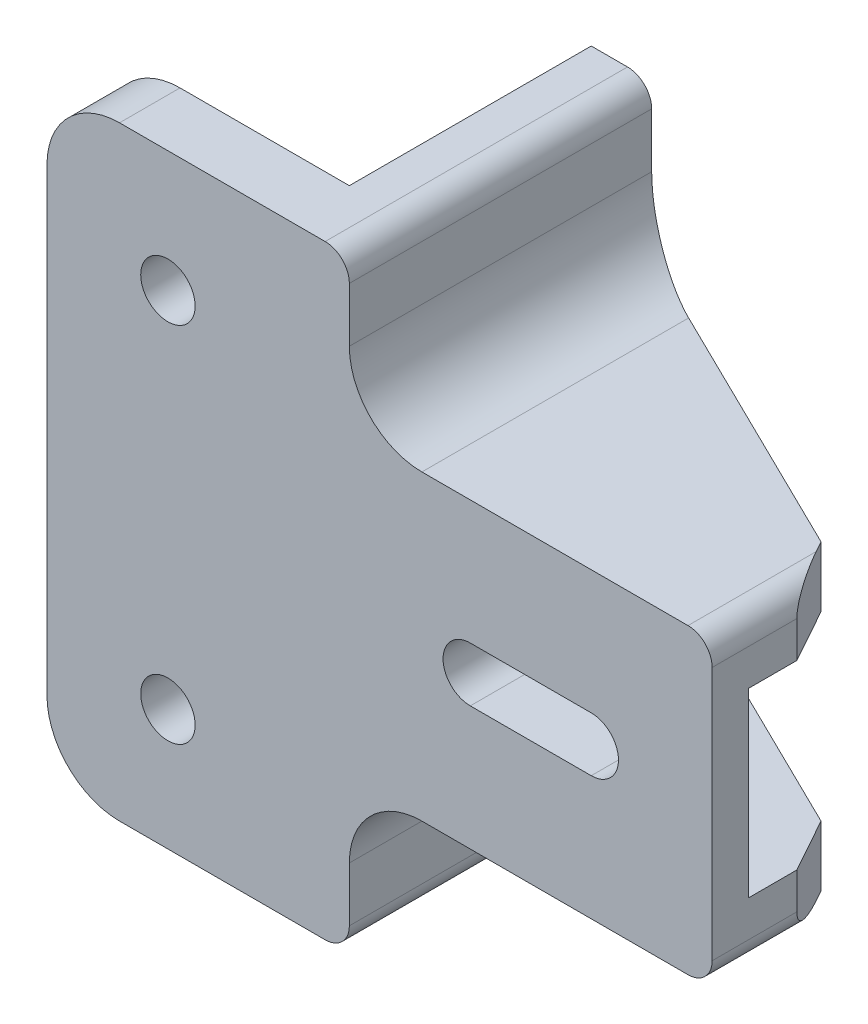
ISO-10303-21;
HEADER;
FILE_DESCRIPTION(('STEP AP214'),'2;1');
FILE_NAME('part.step','',(''),(''),'','','');
FILE_SCHEMA(('AUTOMOTIVE_DESIGN { 1 0 10303 214 1 1 1 1 }'));
ENDSEC;
DATA;
#1=APPLICATION_CONTEXT('core data for automotive mechanical design processes');
#2=APPLICATION_PROTOCOL_DEFINITION('international standard','automotive_design',2000,#1);
#3=PRODUCT_CONTEXT('',#1,'mechanical');
#4=PRODUCT('Part','Part','',(#3));
#5=PRODUCT_RELATED_PRODUCT_CATEGORY('part','',(#4));
#6=PRODUCT_DEFINITION_FORMATION('','',#4);
#7=PRODUCT_DEFINITION_CONTEXT('part definition',#1,'design');
#8=PRODUCT_DEFINITION('design','',#6,#7);
#9=PRODUCT_DEFINITION_SHAPE('','',#8);
#10=(LENGTH_UNIT() NAMED_UNIT(*) SI_UNIT(.MILLI.,.METRE.));
#11=(NAMED_UNIT(*) PLANE_ANGLE_UNIT() SI_UNIT($,.RADIAN.));
#12=(NAMED_UNIT(*) SI_UNIT($,.STERADIAN.) SOLID_ANGLE_UNIT());
#13=UNCERTAINTY_MEASURE_WITH_UNIT(LENGTH_MEASURE(1.E-05),#10,'distance_accuracy_value','');
#14=(GEOMETRIC_REPRESENTATION_CONTEXT(3) GLOBAL_UNCERTAINTY_ASSIGNED_CONTEXT((#13)) GLOBAL_UNIT_ASSIGNED_CONTEXT((#10,
#11,#12)) REPRESENTATION_CONTEXT('',''));
#15=CARTESIAN_POINT('',(0.,0.,0.));
#16=DIRECTION('',(0.,0.,1.));
#17=DIRECTION('',(1.,0.,0.));
#18=AXIS2_PLACEMENT_3D('',#15,#16,#17);
#19=CARTESIAN_POINT('',(-30.,-12.5,5.));
#20=DIRECTION('',(-1.,0.,0.));
#21=DIRECTION('',(0.,0.,1.));
#22=AXIS2_PLACEMENT_3D('',#19,#20,#21);
#23=PLANE('',#22);
#24=DIRECTION('',(0.,1.,0.));
#25=VECTOR('',#24,1.);
#26=CARTESIAN_POINT('',(-30.,-12.5,5.));
#27=LINE('',#26,#25);
#28=CARTESIAN_POINT('',(-30.,-10.5,5.));
#29=VERTEX_POINT('',#28);
#30=CARTESIAN_POINT('',(-30.,-6.,5.));
#31=VERTEX_POINT('',#30);
#32=EDGE_CURVE('E424',#29,#31,#27,.T.);
#33=ORIENTED_EDGE('',*,*,#32,.F.);
#34=DIRECTION('',(0.,0.,-1.));
#35=VECTOR('',#34,1.);
#36=CARTESIAN_POINT('',(-30.,-10.5,5.));
#37=LINE('',#36,#35);
#38=CARTESIAN_POINT('',(-30.,-10.5,-20.));
#39=VERTEX_POINT('',#38);
#40=EDGE_CURVE('E558',#29,#39,#37,.T.);
#41=ORIENTED_EDGE('',*,*,#40,.T.);
#42=DIRECTION('',(0.,-1.,0.));
#43=VECTOR('',#42,1.);
#44=CARTESIAN_POINT('',(-30.,-12.5,-20.));
#45=LINE('',#44,#43);
#46=CARTESIAN_POINT('',(-30.,-6.,-20.));
#47=VERTEX_POINT('',#46);
#48=EDGE_CURVE('E323',#47,#39,#45,.T.);
#49=ORIENTED_EDGE('',*,*,#48,.F.);
#50=DIRECTION('',(0.,0.,-1.));
#51=VECTOR('',#50,1.);
#52=CARTESIAN_POINT('',(-30.,-6.,5.));
#53=LINE('',#52,#51);
#54=EDGE_CURVE('E456',#47,#31,#53,.F.);
#55=ORIENTED_EDGE('',*,*,#54,.T.);
#56=EDGE_LOOP('',(#33,#41,#49,#55));
#57=FACE_BOUND('',#56,.T.);
#58=ADVANCED_FACE('F38',(#57),#23,.F.);
#59=CARTESIAN_POINT('',(-30.,35.5,-20.));
#60=VERTEX_POINT('',#59);
#61=CARTESIAN_POINT('',(-30.,31.,-20.));
#62=VERTEX_POINT('',#61);
#63=EDGE_CURVE('E318',#60,#62,#45,.T.);
#64=ORIENTED_EDGE('',*,*,#63,.F.);
#65=DIRECTION('',(0.,0.,-1.));
#66=VECTOR('',#65,1.);
#67=CARTESIAN_POINT('',(-30.,35.5,5.));
#68=LINE('',#67,#66);
#69=CARTESIAN_POINT('',(-30.,35.5,5.));
#70=VERTEX_POINT('',#69);
#71=EDGE_CURVE('E543',#60,#70,#68,.F.);
#72=ORIENTED_EDGE('',*,*,#71,.T.);
#73=DIRECTION('',(0.,1.,0.));
#74=VECTOR('',#73,1.);
#75=CARTESIAN_POINT('',(-30.,25.,5.));
#76=LINE('',#75,#74);
#77=CARTESIAN_POINT('',(-30.,31.,5.));
#78=VERTEX_POINT('',#77);
#79=EDGE_CURVE('E408',#78,#70,#76,.T.);
#80=ORIENTED_EDGE('',*,*,#79,.F.);
#81=DIRECTION('',(0.,0.,-1.));
#82=VECTOR('',#81,1.);
#83=CARTESIAN_POINT('',(-30.,31.,-20.));
#84=LINE('',#83,#82);
#85=EDGE_CURVE('E460',#78,#62,#84,.T.);
#86=ORIENTED_EDGE('',*,*,#85,.T.);
#87=EDGE_LOOP('',(#64,#72,#80,#86));
#88=FACE_BOUND('',#87,.T.);
#89=ADVANCED_FACE('F651',(#88),#23,.F.);
#90=CARTESIAN_POINT('',(0.,0.,0.));
#91=DIRECTION('',(0.,0.,-1.));
#92=DIRECTION('',(-1.,0.,0.));
#93=AXIS2_PLACEMENT_3D('',#90,#91,#92);
#94=PLANE('',#93);
#95=DIRECTION('',(1.,0.,0.));
#96=VECTOR('',#95,1.);
#97=CARTESIAN_POINT('',(-30.,20.,0.));
#98=LINE('',#97,#96);
#99=CARTESIAN_POINT('',(-28.,20.,0.));
#100=VERTEX_POINT('',#99);
#101=CARTESIAN_POINT('',(-1.99999999999999,20.,0.));
#102=VERTEX_POINT('',#101);
#103=EDGE_CURVE('E302',#100,#102,#98,.T.);
#104=ORIENTED_EDGE('',*,*,#103,.T.);
#105=DIRECTION('',(0.,-1.,0.));
#106=VECTOR('',#105,1.);
#107=CARTESIAN_POINT('',(-1.99999999999999,5.,0.));
#108=LINE('',#107,#106);
#109=CARTESIAN_POINT('',(-1.99999999999999,5.,0.));
#110=VERTEX_POINT('',#109);
#111=EDGE_CURVE('E486',#102,#110,#108,.T.);
#112=ORIENTED_EDGE('',*,*,#111,.T.);
#113=DIRECTION('',(1.,0.,0.));
#114=VECTOR('',#113,1.);
#115=CARTESIAN_POINT('',(-30.,5.,0.));
#116=LINE('',#115,#114);
#117=CARTESIAN_POINT('',(-28.,5.,0.));
#118=VERTEX_POINT('',#117);
#119=EDGE_CURVE('E292',#118,#110,#116,.T.);
#120=ORIENTED_EDGE('',*,*,#119,.F.);
#121=DIRECTION('',(0.,1.,0.));
#122=VECTOR('',#121,1.);
#123=CARTESIAN_POINT('',(-28.,0.,0.));
#124=LINE('',#123,#122);
#125=EDGE_CURVE('E483',#118,#100,#124,.T.);
#126=ORIENTED_EDGE('',*,*,#125,.T.);
#127=EDGE_LOOP('',(#104,#112,#120,#126));
#128=FACE_BOUND('',#127,.T.);
#129=CARTESIAN_POINT('',(-10.,12.5,0.));
#130=DIRECTION('',(0.,0.,1.));
#131=DIRECTION('',(1.,0.,0.));
#132=AXIS2_PLACEMENT_3D('',#129,#130,#131);
#133=CIRCLE('',#132,2.25);
#134=CARTESIAN_POINT('',(-10.,10.25,0.));
#135=VERTEX_POINT('',#134);
#136=CARTESIAN_POINT('',(-10.,14.75,0.));
#137=VERTEX_POINT('',#136);
#138=EDGE_CURVE('E345',#135,#137,#133,.T.);
#139=ORIENTED_EDGE('',*,*,#138,.T.);
#140=DIRECTION('',(-1.,0.,0.));
#141=VECTOR('',#140,1.);
#142=CARTESIAN_POINT('',(-10.,14.75,0.));
#143=LINE('',#142,#141);
#144=CARTESIAN_POINT('',(-20.,14.75,0.));
#145=VERTEX_POINT('',#144);
#146=EDGE_CURVE('E349',#137,#145,#143,.T.);
#147=ORIENTED_EDGE('',*,*,#146,.T.);
#148=CARTESIAN_POINT('',(-20.,12.5,0.));
#149=DIRECTION('',(0.,0.,1.));
#150=DIRECTION('',(1.,0.,0.));
#151=AXIS2_PLACEMENT_3D('',#148,#149,#150);
#152=CIRCLE('',#151,2.25);
#153=CARTESIAN_POINT('',(-20.,10.25,0.));
#154=VERTEX_POINT('',#153);
#155=EDGE_CURVE('E354',#145,#154,#152,.T.);
#156=ORIENTED_EDGE('',*,*,#155,.T.);
#157=DIRECTION('',(1.,0.,0.));
#158=VECTOR('',#157,1.);
#159=CARTESIAN_POINT('',(-10.,10.25,0.));
#160=LINE('',#159,#158);
#161=EDGE_CURVE('E358',#154,#135,#160,.T.);
#162=ORIENTED_EDGE('',*,*,#161,.T.);
#163=EDGE_LOOP('',(#139,#147,#156,#162));
#164=FACE_BOUND('',#163,.T.);
#165=ADVANCED_FACE('F628',(#128,#164),#94,.T.);
#166=CARTESIAN_POINT('',(0.,25.,5.));
#167=DIRECTION('',(0.,-1.,0.));
#168=DIRECTION('',(1.,0.,0.));
#169=AXIS2_PLACEMENT_3D('',#166,#167,#168);
#170=PLANE('',#169);
#171=DIRECTION('',(-1.,0.,0.));
#172=VECTOR('',#171,1.);
#173=CARTESIAN_POINT('',(0.,25.,5.));
#174=LINE('',#173,#172);
#175=CARTESIAN_POINT('',(-2.,25.,5.));
#176=VERTEX_POINT('',#175);
#177=CARTESIAN_POINT('',(-24.,25.,5.));
#178=VERTEX_POINT('',#177);
#179=EDGE_CURVE('E405',#176,#178,#174,.T.);
#180=ORIENTED_EDGE('',*,*,#179,.F.);
#181=DIRECTION('',(0.,0.,-1.));
#182=VECTOR('',#181,1.);
#183=CARTESIAN_POINT('',(-2.,25.,5.));
#184=LINE('',#183,#182);
#185=CARTESIAN_POINT('',(-2.,25.,-5.6));
#186=VERTEX_POINT('',#185);
#187=EDGE_CURVE('E263',#176,#186,#184,.T.);
#188=ORIENTED_EDGE('',*,*,#187,.T.);
#189=DIRECTION('',(0.485642931178632,0.,0.874157276121538));
#190=VECTOR('',#189,1.);
#191=CARTESIAN_POINT('',(0.,25.,-2.));
#192=LINE('',#191,#190);
#193=CARTESIAN_POINT('',(-2.5,25.,-6.5));
#194=VERTEX_POINT('',#193);
#195=EDGE_CURVE('E249',#194,#186,#192,.T.);
#196=ORIENTED_EDGE('',*,*,#195,.F.);
#197=DIRECTION('',(0.89766761056177,0.,0.440673190639415));
#198=VECTOR('',#197,1.);
#199=CARTESIAN_POINT('',(-2.5,25.,-6.5));
#200=LINE('',#199,#198);
#201=CARTESIAN_POINT('',(-24.,25.,-17.0545454545455));
#202=VERTEX_POINT('',#201);
#203=EDGE_CURVE('E235',#202,#194,#200,.T.);
#204=ORIENTED_EDGE('',*,*,#203,.F.);
#205=DIRECTION('',(0.,0.,-1.));
#206=VECTOR('',#205,1.);
#207=CARTESIAN_POINT('',(-24.,25.,5.));
#208=LINE('',#207,#206);
#209=EDGE_CURVE('E464',#202,#178,#208,.F.);
#210=ORIENTED_EDGE('',*,*,#209,.T.);
#211=EDGE_LOOP('',(#180,#188,#196,#204,#210));
#212=FACE_BOUND('',#211,.T.);
#213=ADVANCED_FACE('F261',(#212),#170,.F.);
#214=CARTESIAN_POINT('',(-30.,37.5,5.));
#215=DIRECTION('',(0.,-1.,0.));
#216=DIRECTION('',(0.,0.,-1.));
#217=AXIS2_PLACEMENT_3D('',#214,#215,#216);
#218=PLANE('',#217);
#219=DIRECTION('',(-1.,0.,0.));
#220=VECTOR('',#219,1.);
#221=CARTESIAN_POINT('',(-30.,37.5,5.));
#222=LINE('',#221,#220);
#223=CARTESIAN_POINT('',(-32.,37.5,5.));
#224=VERTEX_POINT('',#223);
#225=CARTESIAN_POINT('',(-49.,37.5,5.));
#226=VERTEX_POINT('',#225);
#227=EDGE_CURVE('E413',#224,#226,#222,.T.);
#228=ORIENTED_EDGE('',*,*,#227,.F.);
#229=DIRECTION('',(0.,0.,-1.));
#230=VECTOR('',#229,1.);
#231=CARTESIAN_POINT('',(-32.,37.5,5.));
#232=LINE('',#231,#230);
#233=CARTESIAN_POINT('',(-32.,37.5,-20.));
#234=VERTEX_POINT('',#233);
#235=EDGE_CURVE('E533',#224,#234,#232,.T.);
#236=ORIENTED_EDGE('',*,*,#235,.T.);
#237=DIRECTION('',(1.,0.,0.));
#238=VECTOR('',#237,1.);
#239=CARTESIAN_POINT('',(-30.,37.5,-20.));
#240=LINE('',#239,#238);
#241=CARTESIAN_POINT('',(-35.,37.5,-20.));
#242=VERTEX_POINT('',#241);
#243=EDGE_CURVE('E329',#242,#234,#240,.T.);
#244=ORIENTED_EDGE('',*,*,#243,.F.);
#245=DIRECTION('',(0.,0.,1.));
#246=VECTOR('',#245,1.);
#247=CARTESIAN_POINT('',(-35.,37.5,-20.));
#248=LINE('',#247,#246);
#249=CARTESIAN_POINT('',(-35.,37.5,0.));
#250=VERTEX_POINT('',#249);
#251=EDGE_CURVE('E333',#242,#250,#248,.T.);
#252=ORIENTED_EDGE('',*,*,#251,.T.);
#253=DIRECTION('',(-1.,0.,0.));
#254=VECTOR('',#253,1.);
#255=CARTESIAN_POINT('',(-30.,37.5,0.));
#256=LINE('',#255,#254);
#257=CARTESIAN_POINT('',(-49.,37.5,0.));
#258=VERTEX_POINT('',#257);
#259=EDGE_CURVE('E381',#250,#258,#256,.T.);
#260=ORIENTED_EDGE('',*,*,#259,.T.);
#261=DIRECTION('',(0.,0.,-1.));
#262=VECTOR('',#261,1.);
#263=CARTESIAN_POINT('',(-49.,37.5,5.));
#264=LINE('',#263,#262);
#265=EDGE_CURVE('E529',#258,#226,#264,.F.);
#266=ORIENTED_EDGE('',*,*,#265,.T.);
#267=EDGE_LOOP('',(#228,#236,#244,#252,#260,#266));
#268=FACE_BOUND('',#267,.T.);
#269=ADVANCED_FACE('F811',(#268),#218,.F.);
#270=CARTESIAN_POINT('',(-55.,37.5,5.));
#271=DIRECTION('',(1.,0.,0.));
#272=DIRECTION('',(0.,1.,0.));
#273=AXIS2_PLACEMENT_3D('',#270,#271,#272);
#274=PLANE('',#273);
#275=DIRECTION('',(0.,-1.,0.));
#276=VECTOR('',#275,1.);
#277=CARTESIAN_POINT('',(-55.,37.5,0.));
#278=LINE('',#277,#276);
#279=CARTESIAN_POINT('',(-55.,31.5,0.));
#280=VERTEX_POINT('',#279);
#281=CARTESIAN_POINT('',(-55.,-6.50000000000001,0.));
#282=VERTEX_POINT('',#281);
#283=EDGE_CURVE('E439',#280,#282,#278,.T.);
#284=ORIENTED_EDGE('',*,*,#283,.T.);
#285=DIRECTION('',(0.,0.,-1.));
#286=VECTOR('',#285,1.);
#287=CARTESIAN_POINT('',(-55.,-6.50000000000001,5.));
#288=LINE('',#287,#286);
#289=CARTESIAN_POINT('',(-55.,-6.50000000000001,5.));
#290=VERTEX_POINT('',#289);
#291=EDGE_CURVE('E520',#282,#290,#288,.F.);
#292=ORIENTED_EDGE('',*,*,#291,.T.);
#293=DIRECTION('',(0.,-1.,0.));
#294=VECTOR('',#293,1.);
#295=CARTESIAN_POINT('',(-55.,37.5,5.));
#296=LINE('',#295,#294);
#297=CARTESIAN_POINT('',(-55.,31.5,5.));
#298=VERTEX_POINT('',#297);
#299=EDGE_CURVE('E416',#298,#290,#296,.T.);
#300=ORIENTED_EDGE('',*,*,#299,.F.);
#301=DIRECTION('',(0.,0.,-1.));
#302=VECTOR('',#301,1.);
#303=CARTESIAN_POINT('',(-55.,31.5,5.));
#304=LINE('',#303,#302);
#305=EDGE_CURVE('E516',#298,#280,#304,.T.);
#306=ORIENTED_EDGE('',*,*,#305,.T.);
#307=EDGE_LOOP('',(#284,#292,#300,#306));
#308=FACE_BOUND('',#307,.T.);
#309=ADVANCED_FACE('F669',(#308),#274,.F.);
#310=CARTESIAN_POINT('',(-55.,-12.5,5.));
#311=DIRECTION('',(0.,1.,0.));
#312=DIRECTION('',(0.,0.,1.));
#313=AXIS2_PLACEMENT_3D('',#310,#311,#312);
#314=PLANE('',#313);
#315=DIRECTION('',(-1.,0.,0.));
#316=VECTOR('',#315,1.);
#317=CARTESIAN_POINT('',(-30.,-12.5,-20.));
#318=LINE('',#317,#316);
#319=CARTESIAN_POINT('',(-32.,-12.5,-20.));
#320=VERTEX_POINT('',#319);
#321=CARTESIAN_POINT('',(-35.,-12.5,-20.));
#322=VERTEX_POINT('',#321);
#323=EDGE_CURVE('E321',#320,#322,#318,.T.);
#324=ORIENTED_EDGE('',*,*,#323,.F.);
#325=DIRECTION('',(0.,0.,-1.));
#326=VECTOR('',#325,1.);
#327=CARTESIAN_POINT('',(-32.,-12.5,5.));
#328=LINE('',#327,#326);
#329=CARTESIAN_POINT('',(-32.,-12.5,5.));
#330=VERTEX_POINT('',#329);
#331=EDGE_CURVE('E562',#320,#330,#328,.F.);
#332=ORIENTED_EDGE('',*,*,#331,.T.);
#333=DIRECTION('',(1.,0.,0.));
#334=VECTOR('',#333,1.);
#335=CARTESIAN_POINT('',(-55.,-12.5,5.));
#336=LINE('',#335,#334);
#337=CARTESIAN_POINT('',(-49.,-12.5,5.));
#338=VERTEX_POINT('',#337);
#339=EDGE_CURVE('E420',#338,#330,#336,.T.);
#340=ORIENTED_EDGE('',*,*,#339,.F.);
#341=DIRECTION('',(0.,0.,-1.));
#342=VECTOR('',#341,1.);
#343=CARTESIAN_POINT('',(-49.,-12.5,5.));
#344=LINE('',#343,#342);
#345=CARTESIAN_POINT('',(-49.,-12.5,0.));
#346=VERTEX_POINT('',#345);
#347=EDGE_CURVE('E506',#338,#346,#344,.T.);
#348=ORIENTED_EDGE('',*,*,#347,.T.);
#349=DIRECTION('',(1.,0.,0.));
#350=VECTOR('',#349,1.);
#351=CARTESIAN_POINT('',(-55.,-12.5,0.));
#352=LINE('',#351,#350);
#353=CARTESIAN_POINT('',(-35.,-12.5,0.));
#354=VERTEX_POINT('',#353);
#355=EDGE_CURVE('E409',#346,#354,#352,.T.);
#356=ORIENTED_EDGE('',*,*,#355,.T.);
#357=DIRECTION('',(0.,0.,1.));
#358=VECTOR('',#357,1.);
#359=CARTESIAN_POINT('',(-35.,-12.5,-20.));
#360=LINE('',#359,#358);
#361=EDGE_CURVE('E340',#322,#354,#360,.T.);
#362=ORIENTED_EDGE('',*,*,#361,.F.);
#363=EDGE_LOOP('',(#324,#332,#340,#348,#356,#362));
#364=FACE_BOUND('',#363,.T.);
#365=ADVANCED_FACE('F661',(#364),#314,.F.);
#366=CARTESIAN_POINT('',(-30.,12.5,-10.));
#367=DIRECTION('',(-1.,0.,0.));
#368=DIRECTION('',(0.,0.,1.));
#369=AXIS2_PLACEMENT_3D('',#366,#367,#368);
#370=CIRCLE('',#369,2.25);
#371=CARTESIAN_POINT('',(-30.,12.5,-7.75));
#372=VERTEX_POINT('',#371);
#373=EDGE_CURVE('E313',#372,#372,#370,.T.);
#374=ORIENTED_EDGE('',*,*,#373,.T.);
#375=EDGE_LOOP('',(#374));
#376=FACE_BOUND('',#375,.T.);
#377=DIRECTION('',(0.,0.,-1.));
#378=VECTOR('',#377,1.);
#379=CARTESIAN_POINT('',(-30.,20.,-20.));
#380=LINE('',#379,#378);
#381=CARTESIAN_POINT('',(-30.,20.,-2.00000000000002));
#382=VERTEX_POINT('',#381);
#383=CARTESIAN_POINT('',(-30.,20.,-20.));
#384=VERTEX_POINT('',#383);
#385=EDGE_CURVE('E299',#382,#384,#380,.T.);
#386=ORIENTED_EDGE('',*,*,#385,.F.);
#387=DIRECTION('',(0.,-1.,0.));
#388=VECTOR('',#387,1.);
#389=CARTESIAN_POINT('',(-30.,-12.5,-2.00000000000002));
#390=LINE('',#389,#388);
#391=CARTESIAN_POINT('',(-30.,5.,-2.00000000000002));
#392=VERTEX_POINT('',#391);
#393=EDGE_CURVE('E489',#382,#392,#390,.T.);
#394=ORIENTED_EDGE('',*,*,#393,.T.);
#395=DIRECTION('',(0.,0.,1.));
#396=VECTOR('',#395,1.);
#397=CARTESIAN_POINT('',(-30.,5.00000000000001,-20.));
#398=LINE('',#397,#396);
#399=CARTESIAN_POINT('',(-30.,5.00000000000001,-20.));
#400=VERTEX_POINT('',#399);
#401=EDGE_CURVE('E288',#400,#392,#398,.T.);
#402=ORIENTED_EDGE('',*,*,#401,.F.);
#403=EDGE_CURVE('E322',#384,#400,#45,.T.);
#404=ORIENTED_EDGE('',*,*,#403,.F.);
#405=EDGE_LOOP('',(#386,#394,#402,#404));
#406=FACE_BOUND('',#405,.T.);
#407=ADVANCED_FACE('F622',(#376,#406),#23,.F.);
#408=CARTESIAN_POINT('',(-30.,0.,5.));
#409=DIRECTION('',(0.,1.,0.));
#410=DIRECTION('',(0.,0.,1.));
#411=AXIS2_PLACEMENT_3D('',#408,#409,#410);
#412=PLANE('',#411);
#413=DIRECTION('',(0.485642931178632,0.,0.874157276121538));
#414=VECTOR('',#413,1.);
#415=CARTESIAN_POINT('',(-4.10377358490566,0.,-9.38679245283019));
#416=LINE('',#415,#414);
#417=CARTESIAN_POINT('',(-2.49999999999999,0.,-6.5));
#418=VERTEX_POINT('',#417);
#419=CARTESIAN_POINT('',(-2.,0.,-5.60000000000001));
#420=VERTEX_POINT('',#419);
#421=EDGE_CURVE('E278',#418,#420,#416,.T.);
#422=ORIENTED_EDGE('',*,*,#421,.T.);
#423=DIRECTION('',(0.,0.,-1.));
#424=VECTOR('',#423,1.);
#425=CARTESIAN_POINT('',(-2.,0.,5.));
#426=LINE('',#425,#424);
#427=CARTESIAN_POINT('',(-2.,0.,5.));
#428=VERTEX_POINT('',#427);
#429=EDGE_CURVE('E11',#420,#428,#426,.F.);
#430=ORIENTED_EDGE('',*,*,#429,.T.);
#431=DIRECTION('',(1.,0.,0.));
#432=VECTOR('',#431,1.);
#433=CARTESIAN_POINT('',(-30.,0.,5.));
#434=LINE('',#433,#432);
#435=CARTESIAN_POINT('',(-24.,0.,5.));
#436=VERTEX_POINT('',#435);
#437=EDGE_CURVE('E427',#436,#428,#434,.T.);
#438=ORIENTED_EDGE('',*,*,#437,.F.);
#439=DIRECTION('',(0.,0.,-1.));
#440=VECTOR('',#439,1.);
#441=CARTESIAN_POINT('',(-24.,0.,-20.));
#442=LINE('',#441,#440);
#443=CARTESIAN_POINT('',(-24.,0.,-17.0545454545455));
#444=VERTEX_POINT('',#443);
#445=EDGE_CURVE('E452',#436,#444,#442,.T.);
#446=ORIENTED_EDGE('',*,*,#445,.T.);
#447=DIRECTION('',(0.89766761056177,0.,0.440673190639415));
#448=VECTOR('',#447,1.);
#449=CARTESIAN_POINT('',(-20.1105487480021,0.,-15.145178476292));
#450=LINE('',#449,#448);
#451=EDGE_CURVE('E284',#444,#418,#450,.T.);
#452=ORIENTED_EDGE('',*,*,#451,.T.);
#453=EDGE_LOOP('',(#422,#430,#438,#446,#452));
#454=FACE_BOUND('',#453,.T.);
#455=ADVANCED_FACE('F607',(#454),#412,.F.);
#456=CARTESIAN_POINT('',(0.,25.,5.));
#457=DIRECTION('',(-1.,0.,0.));
#458=DIRECTION('',(0.,-1.,0.));
#459=AXIS2_PLACEMENT_3D('',#456,#457,#458);
#460=PLANE('',#459);
#461=DIRECTION('',(0.,1.,0.));
#462=VECTOR('',#461,1.);
#463=CARTESIAN_POINT('',(0.,-12.5,-2.));
#464=LINE('',#463,#462);
#465=CARTESIAN_POINT('',(0.,20.,-2.));
#466=VERTEX_POINT('',#465);
#467=CARTESIAN_POINT('',(0.,23.,-2.));
#468=VERTEX_POINT('',#467);
#469=EDGE_CURVE('E272',#466,#468,#464,.T.);
#470=ORIENTED_EDGE('',*,*,#469,.T.);
#471=DIRECTION('',(0.,0.,-1.));
#472=VECTOR('',#471,1.);
#473=CARTESIAN_POINT('',(0.,23.,5.));
#474=LINE('',#473,#472);
#475=CARTESIAN_POINT('',(0.,23.,5.));
#476=VERTEX_POINT('',#475);
#477=EDGE_CURVE('E573',#468,#476,#474,.F.);
#478=ORIENTED_EDGE('',*,*,#477,.T.);
#479=DIRECTION('',(0.,1.,0.));
#480=VECTOR('',#479,1.);
#481=CARTESIAN_POINT('',(0.,25.,5.));
#482=LINE('',#481,#480);
#483=CARTESIAN_POINT('',(0.,2.,5.));
#484=VERTEX_POINT('',#483);
#485=EDGE_CURVE('E431',#484,#476,#482,.T.);
#486=ORIENTED_EDGE('',*,*,#485,.F.);
#487=DIRECTION('',(0.,0.,-1.));
#488=VECTOR('',#487,1.);
#489=CARTESIAN_POINT('',(0.,2.,5.));
#490=LINE('',#489,#488);
#491=CARTESIAN_POINT('',(0.,2.,-2.));
#492=VERTEX_POINT('',#491);
#493=EDGE_CURVE('E570',#484,#492,#490,.T.);
#494=ORIENTED_EDGE('',*,*,#493,.T.);
#495=CARTESIAN_POINT('',(0.,5.,-2.));
#496=VERTEX_POINT('',#495);
#497=EDGE_CURVE('E271',#492,#496,#464,.T.);
#498=ORIENTED_EDGE('',*,*,#497,.T.);
#499=DIRECTION('',(0.,0.,1.));
#500=VECTOR('',#499,1.);
#501=CARTESIAN_POINT('',(0.,5.00000000000001,-20.));
#502=LINE('',#501,#500);
#503=CARTESIAN_POINT('',(0.,5.,1.99999999999999));
#504=VERTEX_POINT('',#503);
#505=EDGE_CURVE('E287',#496,#504,#502,.T.);
#506=ORIENTED_EDGE('',*,*,#505,.T.);
#507=DIRECTION('',(0.,1.,0.));
#508=VECTOR('',#507,1.);
#509=CARTESIAN_POINT('',(0.,20.,1.99999999999999));
#510=LINE('',#509,#508);
#511=CARTESIAN_POINT('',(0.,20.,1.99999999999999));
#512=VERTEX_POINT('',#511);
#513=EDGE_CURVE('E479',#504,#512,#510,.T.);
#514=ORIENTED_EDGE('',*,*,#513,.T.);
#515=DIRECTION('',(0.,0.,-1.));
#516=VECTOR('',#515,1.);
#517=CARTESIAN_POINT('',(0.,20.,-20.));
#518=LINE('',#517,#516);
#519=EDGE_CURVE('E298',#512,#466,#518,.T.);
#520=ORIENTED_EDGE('',*,*,#519,.T.);
#521=EDGE_LOOP('',(#470,#478,#486,#494,#498,#506,#514,#520));
#522=FACE_BOUND('',#521,.T.);
#523=ADVANCED_FACE('F597',(#522),#460,.F.);
#524=CARTESIAN_POINT('',(0.,0.,5.));
#525=DIRECTION('',(0.,0.,-1.));
#526=DIRECTION('',(-1.,0.,0.));
#527=AXIS2_PLACEMENT_3D('',#524,#525,#526);
#528=PLANE('',#527);
#529=DIRECTION('',(-1.,0.,0.));
#530=VECTOR('',#529,1.);
#531=CARTESIAN_POINT('',(-10.,14.75,5.));
#532=LINE('',#531,#530);
#533=CARTESIAN_POINT('',(-10.,14.75,5.));
#534=VERTEX_POINT('',#533);
#535=CARTESIAN_POINT('',(-20.,14.75,5.));
#536=VERTEX_POINT('',#535);
#537=EDGE_CURVE('E366',#534,#536,#532,.T.);
#538=ORIENTED_EDGE('',*,*,#537,.F.);
#539=CARTESIAN_POINT('',(-10.,12.5,5.));
#540=DIRECTION('',(0.,0.,1.));
#541=DIRECTION('',(1.,0.,0.));
#542=AXIS2_PLACEMENT_3D('',#539,#540,#541);
#543=CIRCLE('',#542,2.25);
#544=CARTESIAN_POINT('',(-10.,10.25,5.));
#545=VERTEX_POINT('',#544);
#546=EDGE_CURVE('E363',#545,#534,#543,.T.);
#547=ORIENTED_EDGE('',*,*,#546,.F.);
#548=DIRECTION('',(1.,0.,0.));
#549=VECTOR('',#548,1.);
#550=CARTESIAN_POINT('',(-10.,10.25,5.));
#551=LINE('',#550,#549);
#552=CARTESIAN_POINT('',(-20.,10.25,5.));
#553=VERTEX_POINT('',#552);
#554=EDGE_CURVE('E350',#553,#545,#551,.T.);
#555=ORIENTED_EDGE('',*,*,#554,.F.);
#556=CARTESIAN_POINT('',(-20.,12.5,5.));
#557=DIRECTION('',(0.,0.,1.));
#558=DIRECTION('',(1.,0.,0.));
#559=AXIS2_PLACEMENT_3D('',#556,#557,#558);
#560=CIRCLE('',#559,2.25);
#561=EDGE_CURVE('E371',#536,#553,#560,.T.);
#562=ORIENTED_EDGE('',*,*,#561,.F.);
#563=EDGE_LOOP('',(#538,#547,#555,#562));
#564=FACE_BOUND('',#563,.T.);
#565=CARTESIAN_POINT('',(-45.,-2.5,5.));
#566=DIRECTION('',(0.,0.,1.));
#567=DIRECTION('',(1.,0.,0.));
#568=AXIS2_PLACEMENT_3D('',#565,#566,#567);
#569=CIRCLE('',#568,2.25);
#570=CARTESIAN_POINT('',(-42.75,-2.5,5.));
#571=VERTEX_POINT('',#570);
#572=EDGE_CURVE('E394',#571,#571,#569,.T.);
#573=ORIENTED_EDGE('',*,*,#572,.F.);
#574=EDGE_LOOP('',(#573));
#575=FACE_BOUND('',#574,.T.);
#576=CARTESIAN_POINT('',(-45.,27.5,5.));
#577=DIRECTION('',(0.,0.,1.));
#578=DIRECTION('',(-1.,0.,0.));
#579=AXIS2_PLACEMENT_3D('',#576,#577,#578);
#580=CIRCLE('',#579,2.25);
#581=CARTESIAN_POINT('',(-47.25,27.5,5.));
#582=VERTEX_POINT('',#581);
#583=EDGE_CURVE('E344',#582,#582,#580,.T.);
#584=ORIENTED_EDGE('',*,*,#583,.F.);
#585=EDGE_LOOP('',(#584));
#586=FACE_BOUND('',#585,.T.);
#587=ORIENTED_EDGE('',*,*,#79,.T.);
#588=CARTESIAN_POINT('',(-32.,35.5,5.));
#589=DIRECTION('',(0.,0.,-1.));
#590=DIRECTION('',(-1.,0.,0.));
#591=AXIS2_PLACEMENT_3D('',#588,#589,#590);
#592=CIRCLE('',#591,2.);
#593=EDGE_CURVE('E555',#70,#224,#592,.F.);
#594=ORIENTED_EDGE('',*,*,#593,.T.);
#595=ORIENTED_EDGE('',*,*,#227,.T.);
#596=CARTESIAN_POINT('',(-49.,31.5,5.));
#597=DIRECTION('',(0.,0.,-1.));
#598=DIRECTION('',(-1.,0.,0.));
#599=AXIS2_PLACEMENT_3D('',#596,#597,#598);
#600=CIRCLE('',#599,6.);
#601=EDGE_CURVE('E523',#226,#298,#600,.F.);
#602=ORIENTED_EDGE('',*,*,#601,.T.);
#603=ORIENTED_EDGE('',*,*,#299,.T.);
#604=CARTESIAN_POINT('',(-49.,-6.50000000000001,5.));
#605=DIRECTION('',(0.,0.,-1.));
#606=DIRECTION('',(-1.,0.,0.));
#607=AXIS2_PLACEMENT_3D('',#604,#605,#606);
#608=CIRCLE('',#607,6.);
#609=EDGE_CURVE('E526',#290,#338,#608,.F.);
#610=ORIENTED_EDGE('',*,*,#609,.T.);
#611=ORIENTED_EDGE('',*,*,#339,.T.);
#612=CARTESIAN_POINT('',(-32.,-10.5,5.));
#613=DIRECTION('',(0.,0.,-1.));
#614=DIRECTION('',(-1.,0.,0.));
#615=AXIS2_PLACEMENT_3D('',#612,#613,#614);
#616=CIRCLE('',#615,2.);
#617=EDGE_CURVE('E552',#330,#29,#616,.F.);
#618=ORIENTED_EDGE('',*,*,#617,.T.);
#619=ORIENTED_EDGE('',*,*,#32,.T.);
#620=CARTESIAN_POINT('',(-24.,-6.,5.));
#621=DIRECTION('',(0.,0.,-1.));
#622=DIRECTION('',(-1.,0.,0.));
#623=AXIS2_PLACEMENT_3D('',#620,#621,#622);
#624=CIRCLE('',#623,6.);
#625=EDGE_CURVE('E471',#31,#436,#624,.T.);
#626=ORIENTED_EDGE('',*,*,#625,.T.);
#627=ORIENTED_EDGE('',*,*,#437,.T.);
#628=CARTESIAN_POINT('',(-2.,2.,5.));
#629=DIRECTION('',(0.,0.,-1.));
#630=DIRECTION('',(-1.,0.,0.));
#631=AXIS2_PLACEMENT_3D('',#628,#629,#630);
#632=CIRCLE('',#631,2.);
#633=EDGE_CURVE('E546',#428,#484,#632,.F.);
#634=ORIENTED_EDGE('',*,*,#633,.T.);
#635=ORIENTED_EDGE('',*,*,#485,.T.);
#636=CARTESIAN_POINT('',(-2.,23.,5.));
#637=DIRECTION('',(0.,0.,-1.));
#638=DIRECTION('',(-1.,0.,0.));
#639=AXIS2_PLACEMENT_3D('',#636,#637,#638);
#640=CIRCLE('',#639,2.);
#641=EDGE_CURVE('E549',#476,#176,#640,.F.);
#642=ORIENTED_EDGE('',*,*,#641,.T.);
#643=ORIENTED_EDGE('',*,*,#179,.T.);
#644=CARTESIAN_POINT('',(-24.,31.,5.));
#645=DIRECTION('',(0.,0.,-1.));
#646=DIRECTION('',(-1.,0.,0.));
#647=AXIS2_PLACEMENT_3D('',#644,#645,#646);
#648=CIRCLE('',#647,6.);
#649=EDGE_CURVE('E476',#178,#78,#648,.T.);
#650=ORIENTED_EDGE('',*,*,#649,.T.);
#651=EDGE_LOOP('',(#587,#594,#595,#602,#603,#610,#611,#618,#619,#626,#627,#634,#635,#642,#643,#650));
#652=FACE_BOUND('',#651,.T.);
#653=ADVANCED_FACE('F601',(#564,#575,#586,#652),#528,.F.);
#654=ORIENTED_EDGE('',*,*,#355,.F.);
#655=CARTESIAN_POINT('',(-49.,-6.50000000000001,0.));
#656=DIRECTION('',(0.,0.,-1.));
#657=DIRECTION('',(-1.,0.,0.));
#658=AXIS2_PLACEMENT_3D('',#655,#656,#657);
#659=CIRCLE('',#658,6.);
#660=EDGE_CURVE('E513',#346,#282,#659,.T.);
#661=ORIENTED_EDGE('',*,*,#660,.T.);
#662=ORIENTED_EDGE('',*,*,#283,.F.);
#663=CARTESIAN_POINT('',(-49.,31.5,0.));
#664=DIRECTION('',(0.,0.,-1.));
#665=DIRECTION('',(-1.,0.,0.));
#666=AXIS2_PLACEMENT_3D('',#663,#664,#665);
#667=CIRCLE('',#666,6.);
#668=EDGE_CURVE('E510',#280,#258,#667,.T.);
#669=ORIENTED_EDGE('',*,*,#668,.T.);
#670=ORIENTED_EDGE('',*,*,#259,.F.);
#671=DIRECTION('',(0.,1.,0.));
#672=VECTOR('',#671,1.);
#673=CARTESIAN_POINT('',(-35.,-12.5,0.));
#674=LINE('',#673,#672);
#675=EDGE_CURVE('E317',#354,#250,#674,.T.);
#676=ORIENTED_EDGE('',*,*,#675,.F.);
#677=EDGE_LOOP('',(#654,#661,#662,#669,#670,#676));
#678=FACE_BOUND('',#677,.T.);
#679=CARTESIAN_POINT('',(-45.,-2.5,0.));
#680=DIRECTION('',(0.,0.,1.));
#681=DIRECTION('',(1.,0.,0.));
#682=AXIS2_PLACEMENT_3D('',#679,#680,#681);
#683=CIRCLE('',#682,2.25);
#684=CARTESIAN_POINT('',(-42.75,-2.5,0.));
#685=VERTEX_POINT('',#684);
#686=EDGE_CURVE('E367',#685,#685,#683,.T.);
#687=ORIENTED_EDGE('',*,*,#686,.T.);
#688=EDGE_LOOP('',(#687));
#689=FACE_BOUND('',#688,.T.);
#690=CARTESIAN_POINT('',(-45.,27.5,0.));
#691=DIRECTION('',(0.,0.,1.));
#692=DIRECTION('',(-1.,0.,0.));
#693=AXIS2_PLACEMENT_3D('',#690,#691,#692);
#694=CIRCLE('',#693,2.25);
#695=CARTESIAN_POINT('',(-47.25,27.5,0.));
#696=VERTEX_POINT('',#695);
#697=EDGE_CURVE('E398',#696,#696,#694,.T.);
#698=ORIENTED_EDGE('',*,*,#697,.T.);
#699=EDGE_LOOP('',(#698));
#700=FACE_BOUND('',#699,.T.);
#701=ADVANCED_FACE('F713',(#678,#689,#700),#94,.T.);
#702=CARTESIAN_POINT('',(-45.,27.5,0.));
#703=DIRECTION('',(0.,0.,1.));
#704=DIRECTION('',(1.,0.,0.));
#705=AXIS2_PLACEMENT_3D('',#702,#703,#704);
#706=CYLINDRICAL_SURFACE('',#705,2.25);
#707=ORIENTED_EDGE('',*,*,#697,.F.);
#708=EDGE_LOOP('',(#707));
#709=FACE_BOUND('',#708,.T.);
#710=ORIENTED_EDGE('',*,*,#583,.T.);
#711=EDGE_LOOP('',(#710));
#712=FACE_BOUND('',#711,.T.);
#713=ADVANCED_FACE('F709',(#709,#712),#706,.F.);
#714=CARTESIAN_POINT('',(-45.,-2.5,0.));
#715=DIRECTION('',(0.,0.,1.));
#716=DIRECTION('',(1.,0.,0.));
#717=AXIS2_PLACEMENT_3D('',#714,#715,#716);
#718=CYLINDRICAL_SURFACE('',#717,2.25);
#719=ORIENTED_EDGE('',*,*,#686,.F.);
#720=EDGE_LOOP('',(#719));
#721=FACE_BOUND('',#720,.T.);
#722=ORIENTED_EDGE('',*,*,#572,.T.);
#723=EDGE_LOOP('',(#722));
#724=FACE_BOUND('',#723,.T.);
#725=ADVANCED_FACE('F705',(#721,#724),#718,.F.);
#726=CARTESIAN_POINT('',(-10.,12.5,0.));
#727=DIRECTION('',(0.,0.,1.));
#728=DIRECTION('',(1.,0.,0.));
#729=AXIS2_PLACEMENT_3D('',#726,#727,#728);
#730=CYLINDRICAL_SURFACE('',#729,2.25);
#731=ORIENTED_EDGE('',*,*,#546,.T.);
#732=DIRECTION('',(0.,0.,1.));
#733=VECTOR('',#732,1.);
#734=CARTESIAN_POINT('',(-10.,14.75,0.));
#735=LINE('',#734,#733);
#736=EDGE_CURVE('E362',#137,#534,#735,.T.);
#737=ORIENTED_EDGE('',*,*,#736,.F.);
#738=ORIENTED_EDGE('',*,*,#138,.F.);
#739=DIRECTION('',(0.,0.,1.));
#740=VECTOR('',#739,1.);
#741=CARTESIAN_POINT('',(-10.,10.25,0.));
#742=LINE('',#741,#740);
#743=EDGE_CURVE('E378',#135,#545,#742,.T.);
#744=ORIENTED_EDGE('',*,*,#743,.T.);
#745=EDGE_LOOP('',(#731,#737,#738,#744));
#746=FACE_BOUND('',#745,.T.);
#747=ADVANCED_FACE('F695',(#746),#730,.F.);
#748=CARTESIAN_POINT('',(-10.,10.25,0.));
#749=DIRECTION('',(0.,-1.,0.));
#750=DIRECTION('',(1.,0.,0.));
#751=AXIS2_PLACEMENT_3D('',#748,#749,#750);
#752=PLANE('',#751);
#753=ORIENTED_EDGE('',*,*,#554,.T.);
#754=ORIENTED_EDGE('',*,*,#743,.F.);
#755=ORIENTED_EDGE('',*,*,#161,.F.);
#756=DIRECTION('',(0.,0.,1.));
#757=VECTOR('',#756,1.);
#758=CARTESIAN_POINT('',(-20.,10.25,0.));
#759=LINE('',#758,#757);
#760=EDGE_CURVE('E382',#154,#553,#759,.T.);
#761=ORIENTED_EDGE('',*,*,#760,.T.);
#762=EDGE_LOOP('',(#753,#754,#755,#761));
#763=FACE_BOUND('',#762,.T.);
#764=ADVANCED_FACE('F691',(#763),#752,.F.);
#765=CARTESIAN_POINT('',(-20.,12.5,0.));
#766=DIRECTION('',(0.,0.,1.));
#767=DIRECTION('',(1.,0.,0.));
#768=AXIS2_PLACEMENT_3D('',#765,#766,#767);
#769=CYLINDRICAL_SURFACE('',#768,2.25);
#770=ORIENTED_EDGE('',*,*,#561,.T.);
#771=ORIENTED_EDGE('',*,*,#760,.F.);
#772=ORIENTED_EDGE('',*,*,#155,.F.);
#773=DIRECTION('',(0.,0.,1.));
#774=VECTOR('',#773,1.);
#775=CARTESIAN_POINT('',(-20.,14.75,0.));
#776=LINE('',#775,#774);
#777=EDGE_CURVE('E385',#145,#536,#776,.T.);
#778=ORIENTED_EDGE('',*,*,#777,.T.);
#779=EDGE_LOOP('',(#770,#771,#772,#778));
#780=FACE_BOUND('',#779,.T.);
#781=ADVANCED_FACE('F694',(#780),#769,.F.);
#782=CARTESIAN_POINT('',(-10.,14.75,0.));
#783=DIRECTION('',(0.,1.,0.));
#784=DIRECTION('',(0.,0.,1.));
#785=AXIS2_PLACEMENT_3D('',#782,#783,#784);
#786=PLANE('',#785);
#787=ORIENTED_EDGE('',*,*,#537,.T.);
#788=ORIENTED_EDGE('',*,*,#777,.F.);
#789=ORIENTED_EDGE('',*,*,#146,.F.);
#790=ORIENTED_EDGE('',*,*,#736,.T.);
#791=EDGE_LOOP('',(#787,#788,#789,#790));
#792=FACE_BOUND('',#791,.T.);
#793=ADVANCED_FACE('F689',(#792),#786,.F.);
#794=CARTESIAN_POINT('',(-35.,-12.5,-20.));
#795=DIRECTION('',(1.,0.,0.));
#796=DIRECTION('',(0.,0.,-1.));
#797=AXIS2_PLACEMENT_3D('',#794,#795,#796);
#798=PLANE('',#797);
#799=CARTESIAN_POINT('',(-35.,12.5,-10.));
#800=DIRECTION('',(-1.,0.,0.));
#801=DIRECTION('',(0.,0.,1.));
#802=AXIS2_PLACEMENT_3D('',#799,#800,#801);
#803=CIRCLE('',#802,2.25);
#804=CARTESIAN_POINT('',(-35.,12.5,-7.75));
#805=VERTEX_POINT('',#804);
#806=EDGE_CURVE('E309',#805,#805,#803,.T.);
#807=ORIENTED_EDGE('',*,*,#806,.F.);
#808=EDGE_LOOP('',(#807));
#809=FACE_BOUND('',#808,.T.);
#810=ORIENTED_EDGE('',*,*,#675,.T.);
#811=ORIENTED_EDGE('',*,*,#251,.F.);
#812=DIRECTION('',(0.,1.,0.));
#813=VECTOR('',#812,1.);
#814=CARTESIAN_POINT('',(-35.,-12.5,-20.));
#815=LINE('',#814,#813);
#816=EDGE_CURVE('E326',#322,#242,#815,.T.);
#817=ORIENTED_EDGE('',*,*,#816,.F.);
#818=ORIENTED_EDGE('',*,*,#361,.T.);
#819=EDGE_LOOP('',(#810,#811,#817,#818));
#820=FACE_BOUND('',#819,.T.);
#821=ADVANCED_FACE('F683',(#809,#820),#798,.F.);
#822=CARTESIAN_POINT('',(0.,0.,-20.));
#823=DIRECTION('',(0.,0.,1.));
#824=DIRECTION('',(1.,0.,0.));
#825=AXIS2_PLACEMENT_3D('',#822,#823,#824);
#826=PLANE('',#825);
#827=ORIENTED_EDGE('',*,*,#243,.T.);
#828=CARTESIAN_POINT('',(-32.,35.5,-20.));
#829=DIRECTION('',(0.,0.,1.));
#830=DIRECTION('',(1.,0.,0.));
#831=AXIS2_PLACEMENT_3D('',#828,#829,#830);
#832=CIRCLE('',#831,2.);
#833=EDGE_CURVE('E540',#234,#60,#832,.F.);
#834=ORIENTED_EDGE('',*,*,#833,.T.);
#835=ORIENTED_EDGE('',*,*,#63,.T.);
#836=DIRECTION('',(0.,1.,0.));
#837=VECTOR('',#836,1.);
#838=CARTESIAN_POINT('',(-30.,-12.5,-20.));
#839=LINE('',#838,#837);
#840=EDGE_CURVE('E267',#384,#62,#839,.T.);
#841=ORIENTED_EDGE('',*,*,#840,.F.);
#842=ORIENTED_EDGE('',*,*,#403,.T.);
#843=EDGE_CURVE('E270',#47,#400,#839,.T.);
#844=ORIENTED_EDGE('',*,*,#843,.F.);
#845=ORIENTED_EDGE('',*,*,#48,.T.);
#846=CARTESIAN_POINT('',(-32.,-10.5,-20.));
#847=DIRECTION('',(0.,0.,1.));
#848=DIRECTION('',(1.,0.,0.));
#849=AXIS2_PLACEMENT_3D('',#846,#847,#848);
#850=CIRCLE('',#849,2.);
#851=EDGE_CURVE('E537',#39,#320,#850,.F.);
#852=ORIENTED_EDGE('',*,*,#851,.T.);
#853=ORIENTED_EDGE('',*,*,#323,.T.);
#854=ORIENTED_EDGE('',*,*,#816,.T.);
#855=EDGE_LOOP('',(#827,#834,#835,#841,#842,#844,#845,#852,#853,#854));
#856=FACE_BOUND('',#855,.T.);
#857=ADVANCED_FACE('F616',(#856),#826,.F.);
#858=CARTESIAN_POINT('',(0.,12.5,-10.));
#859=DIRECTION('',(-1.,0.,0.));
#860=DIRECTION('',(0.,0.,1.));
#861=AXIS2_PLACEMENT_3D('',#858,#859,#860);
#862=CYLINDRICAL_SURFACE('',#861,2.25);
#863=ORIENTED_EDGE('',*,*,#806,.T.);
#864=EDGE_LOOP('',(#863));
#865=FACE_BOUND('',#864,.T.);
#866=ORIENTED_EDGE('',*,*,#373,.F.);
#867=EDGE_LOOP('',(#866));
#868=FACE_BOUND('',#867,.T.);
#869=ADVANCED_FACE('F673',(#865,#868),#862,.F.);
#870=CARTESIAN_POINT('',(-30.,20.,-20.));
#871=DIRECTION('',(0.,-1.,0.));
#872=DIRECTION('',(0.,0.,-1.));
#873=AXIS2_PLACEMENT_3D('',#870,#871,#872);
#874=PLANE('',#873);
#875=ORIENTED_EDGE('',*,*,#103,.F.);
#876=DIRECTION('',(-0.707106781186544,0.,-0.707106781186551));
#877=VECTOR('',#876,1.);
#878=CARTESIAN_POINT('',(-39.,20.,-11.0000000000001));
#879=LINE('',#878,#877);
#880=EDGE_CURVE('E496',#100,#382,#879,.T.);
#881=ORIENTED_EDGE('',*,*,#880,.T.);
#882=ORIENTED_EDGE('',*,*,#385,.T.);
#883=DIRECTION('',(-0.89766761056177,0.,-0.440673190639415));
#884=VECTOR('',#883,1.);
#885=CARTESIAN_POINT('',(-30.,20.,-20.));
#886=LINE('',#885,#884);
#887=CARTESIAN_POINT('',(-2.5,20.,-6.5));
#888=VERTEX_POINT('',#887);
#889=EDGE_CURVE('E281',#888,#384,#886,.T.);
#890=ORIENTED_EDGE('',*,*,#889,.F.);
#891=DIRECTION('',(-0.485642931178632,0.,-0.874157276121538));
#892=VECTOR('',#891,1.);
#893=CARTESIAN_POINT('',(-14.7169811320755,20.,-28.4905660377358));
#894=LINE('',#893,#892);
#895=EDGE_CURVE('E255',#466,#888,#894,.T.);
#896=ORIENTED_EDGE('',*,*,#895,.F.);
#897=ORIENTED_EDGE('',*,*,#519,.F.);
#898=DIRECTION('',(-0.707106781186549,0.,-0.707106781186546));
#899=VECTOR('',#898,1.);
#900=CARTESIAN_POINT('',(0.,20.,1.99999999999999));
#901=LINE('',#900,#899);
#902=EDGE_CURVE('E499',#512,#102,#901,.T.);
#903=ORIENTED_EDGE('',*,*,#902,.T.);
#904=EDGE_LOOP('',(#875,#881,#882,#890,#896,#897,#903));
#905=FACE_BOUND('',#904,.T.);
#906=ADVANCED_FACE('F635',(#905),#874,.T.);
#907=CARTESIAN_POINT('',(-30.,5.00000000000001,-20.));
#908=DIRECTION('',(0.,1.,0.));
#909=DIRECTION('',(0.,0.,1.));
#910=AXIS2_PLACEMENT_3D('',#907,#908,#909);
#911=PLANE('',#910);
#912=ORIENTED_EDGE('',*,*,#401,.T.);
#913=DIRECTION('',(0.707106781186544,0.,0.707106781186551));
#914=VECTOR('',#913,1.);
#915=CARTESIAN_POINT('',(-39.,5.,-11.0000000000001));
#916=LINE('',#915,#914);
#917=EDGE_CURVE('E493',#392,#118,#916,.T.);
#918=ORIENTED_EDGE('',*,*,#917,.T.);
#919=ORIENTED_EDGE('',*,*,#119,.T.);
#920=DIRECTION('',(0.707106781186549,0.,0.707106781186546));
#921=VECTOR('',#920,1.);
#922=CARTESIAN_POINT('',(0.,5.,1.99999999999999));
#923=LINE('',#922,#921);
#924=EDGE_CURVE('E502',#110,#504,#923,.T.);
#925=ORIENTED_EDGE('',*,*,#924,.T.);
#926=ORIENTED_EDGE('',*,*,#505,.F.);
#927=DIRECTION('',(0.485642931178632,0.,0.874157276121538));
#928=VECTOR('',#927,1.);
#929=CARTESIAN_POINT('',(-14.7169811320755,5.00000000000001,-28.4905660377359));
#930=LINE('',#929,#928);
#931=CARTESIAN_POINT('',(-2.49999999999999,5.,-6.5));
#932=VERTEX_POINT('',#931);
#933=EDGE_CURVE('E435',#932,#496,#930,.T.);
#934=ORIENTED_EDGE('',*,*,#933,.F.);
#935=DIRECTION('',(0.89766761056177,0.,0.440673190639415));
#936=VECTOR('',#935,1.);
#937=CARTESIAN_POINT('',(-30.,5.00000000000001,-20.));
#938=LINE('',#937,#936);
#939=EDGE_CURVE('E448',#400,#932,#938,.T.);
#940=ORIENTED_EDGE('',*,*,#939,.F.);
#941=EDGE_LOOP('',(#912,#918,#919,#925,#926,#934,#940));
#942=FACE_BOUND('',#941,.T.);
#943=ADVANCED_FACE('F593',(#942),#911,.T.);
#944=CARTESIAN_POINT('',(0.,-12.5,-2.));
#945=DIRECTION('',(-0.874157276121538,0.,0.485642931178632));
#946=DIRECTION('',(0.485642931178632,0.,0.874157276121538));
#947=AXIS2_PLACEMENT_3D('',#944,#945,#946);
#948=PLANE('',#947);
#949=ORIENTED_EDGE('',*,*,#497,.F.);
#950=CARTESIAN_POINT('',(-2.,2.,-5.60000000000001));
#951=DIRECTION('',(-0.874157276121538,0.,0.485642931178632));
#952=DIRECTION('',(-0.485642931178632,0.,-0.874157276121538));
#953=AXIS2_PLACEMENT_3D('',#950,#951,#952);
#954=ELLIPSE('',#953,4.1182520563948,2.);
#955=EDGE_CURVE('E47',#492,#420,#954,.F.);
#956=ORIENTED_EDGE('',*,*,#955,.T.);
#957=ORIENTED_EDGE('',*,*,#421,.F.);
#958=DIRECTION('',(0.,1.,0.));
#959=VECTOR('',#958,1.);
#960=CARTESIAN_POINT('',(-2.49999999999999,-12.5,-6.5));
#961=LINE('',#960,#959);
#962=EDGE_CURVE('E257',#418,#932,#961,.T.);
#963=ORIENTED_EDGE('',*,*,#962,.T.);
#964=ORIENTED_EDGE('',*,*,#933,.T.);
#965=EDGE_LOOP('',(#949,#956,#957,#963,#964));
#966=FACE_BOUND('',#965,.T.);
#967=ADVANCED_FACE('F584',(#966),#948,.F.);
#968=CARTESIAN_POINT('',(-2.49999999999999,-12.5,-6.5));
#969=DIRECTION('',(-0.440673190639415,0.,0.89766761056177));
#970=DIRECTION('',(0.89766761056177,0.,0.440673190639415));
#971=AXIS2_PLACEMENT_3D('',#968,#969,#970);
#972=PLANE('',#971);
#973=ORIENTED_EDGE('',*,*,#843,.T.);
#974=ORIENTED_EDGE('',*,*,#939,.T.);
#975=ORIENTED_EDGE('',*,*,#962,.F.);
#976=ORIENTED_EDGE('',*,*,#451,.F.);
#977=CARTESIAN_POINT('',(-24.,-6.,-17.0545454545455));
#978=DIRECTION('',(-0.440673190639415,0.,0.89766761056177));
#979=DIRECTION('',(0.89766761056177,0.,0.440673190639415));
#980=AXIS2_PLACEMENT_3D('',#977,#978,#979);
#981=ELLIPSE('',#980,6.68398851579944,6.);
#982=EDGE_CURVE('E467',#444,#47,#981,.T.);
#983=ORIENTED_EDGE('',*,*,#982,.T.);
#984=EDGE_LOOP('',(#973,#974,#975,#976,#983));
#985=FACE_BOUND('',#984,.T.);
#986=ADVANCED_FACE('F590',(#985),#972,.F.);
#987=ORIENTED_EDGE('',*,*,#889,.T.);
#988=ORIENTED_EDGE('',*,*,#840,.T.);
#989=CARTESIAN_POINT('',(-24.,31.,-17.0545454545455));
#990=DIRECTION('',(-0.440673190639415,0.,0.89766761056177));
#991=DIRECTION('',(0.89766761056177,0.,0.440673190639415));
#992=AXIS2_PLACEMENT_3D('',#989,#990,#991);
#993=ELLIPSE('',#992,6.68398851579944,6.);
#994=EDGE_CURVE('E243',#62,#202,#993,.T.);
#995=ORIENTED_EDGE('',*,*,#994,.T.);
#996=ORIENTED_EDGE('',*,*,#203,.T.);
#997=EDGE_CURVE('E239',#888,#194,#961,.T.);
#998=ORIENTED_EDGE('',*,*,#997,.F.);
#999=EDGE_LOOP('',(#987,#988,#995,#996,#998));
#1000=FACE_BOUND('',#999,.T.);
#1001=ADVANCED_FACE('F238',(#1000),#972,.F.);
#1002=ORIENTED_EDGE('',*,*,#195,.T.);
#1003=CARTESIAN_POINT('',(-2.,23.,-5.6));
#1004=DIRECTION('',(-0.874157276121538,0.,0.485642931178632));
#1005=DIRECTION('',(-0.485642931178632,0.,-0.874157276121538));
#1006=AXIS2_PLACEMENT_3D('',#1003,#1004,#1005);
#1007=ELLIPSE('',#1006,4.1182520563948,2.);
#1008=EDGE_CURVE('E567',#186,#468,#1007,.F.);
#1009=ORIENTED_EDGE('',*,*,#1008,.T.);
#1010=ORIENTED_EDGE('',*,*,#469,.F.);
#1011=ORIENTED_EDGE('',*,*,#895,.T.);
#1012=ORIENTED_EDGE('',*,*,#997,.T.);
#1013=EDGE_LOOP('',(#1002,#1009,#1010,#1011,#1012));
#1014=FACE_BOUND('',#1013,.T.);
#1015=ADVANCED_FACE('F253',(#1014),#948,.F.);
#1016=CARTESIAN_POINT('',(-24.,-6.,5.));
#1017=DIRECTION('',(0.,0.,1.));
#1018=DIRECTION('',(1.,0.,0.));
#1019=AXIS2_PLACEMENT_3D('',#1016,#1017,#1018);
#1020=CYLINDRICAL_SURFACE('',#1019,6.);
#1021=ORIENTED_EDGE('',*,*,#625,.F.);
#1022=ORIENTED_EDGE('',*,*,#54,.F.);
#1023=ORIENTED_EDGE('',*,*,#982,.F.);
#1024=ORIENTED_EDGE('',*,*,#445,.F.);
#1025=EDGE_LOOP('',(#1021,#1022,#1023,#1024));
#1026=FACE_BOUND('',#1025,.T.);
#1027=ADVANCED_FACE('F609',(#1026),#1020,.F.);
#1028=CARTESIAN_POINT('',(-24.,31.,5.));
#1029=DIRECTION('',(0.,0.,1.));
#1030=DIRECTION('',(1.,0.,0.));
#1031=AXIS2_PLACEMENT_3D('',#1028,#1029,#1030);
#1032=CYLINDRICAL_SURFACE('',#1031,6.);
#1033=ORIENTED_EDGE('',*,*,#649,.F.);
#1034=ORIENTED_EDGE('',*,*,#209,.F.);
#1035=ORIENTED_EDGE('',*,*,#994,.F.);
#1036=ORIENTED_EDGE('',*,*,#85,.F.);
#1037=EDGE_LOOP('',(#1033,#1034,#1035,#1036));
#1038=FACE_BOUND('',#1037,.T.);
#1039=ADVANCED_FACE('F640',(#1038),#1032,.F.);
#1040=CARTESIAN_POINT('',(0.,25.,1.99999999999999));
#1041=DIRECTION('',(0.707106781186546,0.,-0.707106781186549));
#1042=DIRECTION('',(0.,-1.,0.));
#1043=AXIS2_PLACEMENT_3D('',#1040,#1041,#1042);
#1044=PLANE('',#1043);
#1045=ORIENTED_EDGE('',*,*,#924,.F.);
#1046=ORIENTED_EDGE('',*,*,#111,.F.);
#1047=ORIENTED_EDGE('',*,*,#902,.F.);
#1048=ORIENTED_EDGE('',*,*,#513,.F.);
#1049=EDGE_LOOP('',(#1045,#1046,#1047,#1048));
#1050=FACE_BOUND('',#1049,.T.);
#1051=ADVANCED_FACE('F638',(#1050),#1044,.T.);
#1052=CARTESIAN_POINT('',(-30.,-12.5,-2.00000000000002));
#1053=DIRECTION('',(-0.707106781186551,0.,0.707106781186544));
#1054=DIRECTION('',(0.,-1.,0.));
#1055=AXIS2_PLACEMENT_3D('',#1052,#1053,#1054);
#1056=PLANE('',#1055);
#1057=ORIENTED_EDGE('',*,*,#880,.F.);
#1058=ORIENTED_EDGE('',*,*,#125,.F.);
#1059=ORIENTED_EDGE('',*,*,#917,.F.);
#1060=ORIENTED_EDGE('',*,*,#393,.F.);
#1061=EDGE_LOOP('',(#1057,#1058,#1059,#1060));
#1062=FACE_BOUND('',#1061,.T.);
#1063=ADVANCED_FACE('F633',(#1062),#1056,.F.);
#1064=CARTESIAN_POINT('',(-49.,-6.50000000000001,5.));
#1065=DIRECTION('',(0.,0.,-1.));
#1066=DIRECTION('',(-1.,0.,0.));
#1067=AXIS2_PLACEMENT_3D('',#1064,#1065,#1066);
#1068=CYLINDRICAL_SURFACE('',#1067,6.);
#1069=ORIENTED_EDGE('',*,*,#609,.F.);
#1070=ORIENTED_EDGE('',*,*,#291,.F.);
#1071=ORIENTED_EDGE('',*,*,#660,.F.);
#1072=ORIENTED_EDGE('',*,*,#347,.F.);
#1073=EDGE_LOOP('',(#1069,#1070,#1071,#1072));
#1074=FACE_BOUND('',#1073,.T.);
#1075=ADVANCED_FACE('F646',(#1074),#1068,.T.);
#1076=CARTESIAN_POINT('',(-49.,31.5,5.));
#1077=DIRECTION('',(0.,0.,-1.));
#1078=DIRECTION('',(-1.,0.,0.));
#1079=AXIS2_PLACEMENT_3D('',#1076,#1077,#1078);
#1080=CYLINDRICAL_SURFACE('',#1079,6.);
#1081=ORIENTED_EDGE('',*,*,#601,.F.);
#1082=ORIENTED_EDGE('',*,*,#265,.F.);
#1083=ORIENTED_EDGE('',*,*,#668,.F.);
#1084=ORIENTED_EDGE('',*,*,#305,.F.);
#1085=EDGE_LOOP('',(#1081,#1082,#1083,#1084));
#1086=FACE_BOUND('',#1085,.T.);
#1087=ADVANCED_FACE('F756',(#1086),#1080,.T.);
#1088=CARTESIAN_POINT('',(-32.,35.5,5.));
#1089=DIRECTION('',(0.,0.,-1.));
#1090=DIRECTION('',(-1.,0.,0.));
#1091=AXIS2_PLACEMENT_3D('',#1088,#1089,#1090);
#1092=CYLINDRICAL_SURFACE('',#1091,2.);
#1093=ORIENTED_EDGE('',*,*,#593,.F.);
#1094=ORIENTED_EDGE('',*,*,#71,.F.);
#1095=ORIENTED_EDGE('',*,*,#833,.F.);
#1096=ORIENTED_EDGE('',*,*,#235,.F.);
#1097=EDGE_LOOP('',(#1093,#1094,#1095,#1096));
#1098=FACE_BOUND('',#1097,.T.);
#1099=ADVANCED_FACE('F750',(#1098),#1092,.T.);
#1100=CARTESIAN_POINT('',(-32.,-10.5,5.));
#1101=DIRECTION('',(0.,0.,-1.));
#1102=DIRECTION('',(-1.,0.,0.));
#1103=AXIS2_PLACEMENT_3D('',#1100,#1101,#1102);
#1104=CYLINDRICAL_SURFACE('',#1103,2.);
#1105=ORIENTED_EDGE('',*,*,#617,.F.);
#1106=ORIENTED_EDGE('',*,*,#331,.F.);
#1107=ORIENTED_EDGE('',*,*,#851,.F.);
#1108=ORIENTED_EDGE('',*,*,#40,.F.);
#1109=EDGE_LOOP('',(#1105,#1106,#1107,#1108));
#1110=FACE_BOUND('',#1109,.T.);
#1111=ADVANCED_FACE('F755',(#1110),#1104,.T.);
#1112=CARTESIAN_POINT('',(-2.,23.,5.));
#1113=DIRECTION('',(0.,0.,-1.));
#1114=DIRECTION('',(-1.,0.,0.));
#1115=AXIS2_PLACEMENT_3D('',#1112,#1113,#1114);
#1116=CYLINDRICAL_SURFACE('',#1115,2.);
#1117=ORIENTED_EDGE('',*,*,#641,.F.);
#1118=ORIENTED_EDGE('',*,*,#477,.F.);
#1119=ORIENTED_EDGE('',*,*,#1008,.F.);
#1120=ORIENTED_EDGE('',*,*,#187,.F.);
#1121=EDGE_LOOP('',(#1117,#1118,#1119,#1120));
#1122=FACE_BOUND('',#1121,.T.);
#1123=ADVANCED_FACE('F768',(#1122),#1116,.T.);
#1124=CARTESIAN_POINT('',(-2.,2.,5.));
#1125=DIRECTION('',(0.,0.,-1.));
#1126=DIRECTION('',(-1.,0.,0.));
#1127=AXIS2_PLACEMENT_3D('',#1124,#1125,#1126);
#1128=CYLINDRICAL_SURFACE('',#1127,2.);
#1129=ORIENTED_EDGE('',*,*,#633,.F.);
#1130=ORIENTED_EDGE('',*,*,#429,.F.);
#1131=ORIENTED_EDGE('',*,*,#955,.F.);
#1132=ORIENTED_EDGE('',*,*,#493,.F.);
#1133=EDGE_LOOP('',(#1129,#1130,#1131,#1132));
#1134=FACE_BOUND('',#1133,.T.);
#1135=ADVANCED_FACE('F40',(#1134),#1128,.T.);
#1136=CLOSED_SHELL('',(#58,#89,#165,#213,#269,#309,#365,#407,#455,#523,#653,#701,#713,#725,#747,
#764,#781,#793,#821,#857,#869,#906,#943,#967,#986,#1001,#1015,#1027,#1039,#1051,#1063,#1075,
#1087,#1099,#1111,#1123,#1135));
#1137=MANIFOLD_SOLID_BREP('B2',#1136);
#1138=ADVANCED_BREP_SHAPE_REPRESENTATION('',(#18,#1137),#14);
#1139=SHAPE_DEFINITION_REPRESENTATION(#9,#1138);
ENDSEC;
END-ISO-10303-21;
